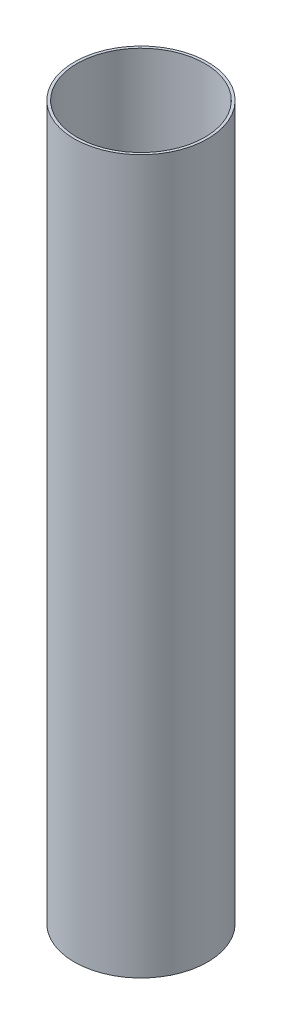
ISO-10303-21;
HEADER;
FILE_DESCRIPTION(('STEP AP214'),'2;1');
FILE_NAME('part.step','',(''),(''),'','','');
FILE_SCHEMA(('AUTOMOTIVE_DESIGN { 1 0 10303 214 1 1 1 1 }'));
ENDSEC;
DATA;
#1=APPLICATION_CONTEXT('core data for automotive mechanical design processes');
#2=APPLICATION_PROTOCOL_DEFINITION('international standard','automotive_design',2000,#1);
#3=PRODUCT_CONTEXT('',#1,'mechanical');
#4=PRODUCT('Part','Part','',(#3));
#5=PRODUCT_RELATED_PRODUCT_CATEGORY('part','',(#4));
#6=PRODUCT_DEFINITION_FORMATION('','',#4);
#7=PRODUCT_DEFINITION_CONTEXT('part definition',#1,'design');
#8=PRODUCT_DEFINITION('design','',#6,#7);
#9=PRODUCT_DEFINITION_SHAPE('','',#8);
#10=(LENGTH_UNIT() NAMED_UNIT(*) SI_UNIT(.MILLI.,.METRE.));
#11=(NAMED_UNIT(*) PLANE_ANGLE_UNIT() SI_UNIT($,.RADIAN.));
#12=(NAMED_UNIT(*) SI_UNIT($,.STERADIAN.) SOLID_ANGLE_UNIT());
#13=UNCERTAINTY_MEASURE_WITH_UNIT(LENGTH_MEASURE(1.E-05),#10,'distance_accuracy_value','');
#14=(GEOMETRIC_REPRESENTATION_CONTEXT(3) GLOBAL_UNCERTAINTY_ASSIGNED_CONTEXT((#13)) GLOBAL_UNIT_ASSIGNED_CONTEXT((#10,
#11,#12)) REPRESENTATION_CONTEXT('',''));
#15=CARTESIAN_POINT('',(0.,0.,0.));
#16=DIRECTION('',(0.,0.,1.));
#17=DIRECTION('',(1.,0.,0.));
#18=AXIS2_PLACEMENT_3D('',#15,#16,#17);
#19=CARTESIAN_POINT('',(0.,304.8,0.));
#20=DIRECTION('',(0.,1.,0.));
#21=DIRECTION('',(0.,0.,1.));
#22=AXIS2_PLACEMENT_3D('',#19,#20,#21);
#23=PLANE('',#22);
#24=CARTESIAN_POINT('',(0.,304.8,0.));
#25=DIRECTION('',(0.,1.,0.));
#26=DIRECTION('',(0.,0.,1.));
#27=AXIS2_PLACEMENT_3D('',#24,#25,#26);
#28=CIRCLE('',#27,28.4734);
#29=CARTESIAN_POINT('',(0.,304.8,28.4734));
#30=VERTEX_POINT('',#29);
#31=EDGE_CURVE('E10',#30,#30,#28,.T.);
#32=ORIENTED_EDGE('',*,*,#31,.T.);
#33=EDGE_LOOP('',(#32));
#34=FACE_BOUND('',#33,.T.);
#35=CARTESIAN_POINT('',(0.,304.8,0.));
#36=DIRECTION('',(0.,1.,0.));
#37=DIRECTION('',(0.,0.,1.));
#38=AXIS2_PLACEMENT_3D('',#35,#36,#37);
#39=CIRCLE('',#38,27.3304);
#40=CARTESIAN_POINT('',(0.,304.8,27.3304));
#41=VERTEX_POINT('',#40);
#42=EDGE_CURVE('E42',#41,#41,#39,.T.);
#43=ORIENTED_EDGE('',*,*,#42,.F.);
#44=EDGE_LOOP('',(#43));
#45=FACE_BOUND('',#44,.T.);
#46=ADVANCED_FACE('F31',(#34,#45),#23,.T.);
#47=CARTESIAN_POINT('',(0.,0.,0.));
#48=DIRECTION('',(0.,1.,0.));
#49=DIRECTION('',(0.,0.,1.));
#50=AXIS2_PLACEMENT_3D('',#47,#48,#49);
#51=PLANE('',#50);
#52=CARTESIAN_POINT('',(0.,0.,0.));
#53=DIRECTION('',(0.,1.,0.));
#54=DIRECTION('',(0.,0.,1.));
#55=AXIS2_PLACEMENT_3D('',#52,#53,#54);
#56=CIRCLE('',#55,28.4734);
#57=CARTESIAN_POINT('',(0.,0.,28.4734));
#58=VERTEX_POINT('',#57);
#59=EDGE_CURVE('E35',#58,#58,#56,.T.);
#60=ORIENTED_EDGE('',*,*,#59,.F.);
#61=EDGE_LOOP('',(#60));
#62=FACE_BOUND('',#61,.T.);
#63=CARTESIAN_POINT('',(0.,0.,0.));
#64=DIRECTION('',(0.,1.,0.));
#65=DIRECTION('',(0.,0.,1.));
#66=AXIS2_PLACEMENT_3D('',#63,#64,#65);
#67=CIRCLE('',#66,27.3304);
#68=CARTESIAN_POINT('',(0.,0.,27.3304));
#69=VERTEX_POINT('',#68);
#70=EDGE_CURVE('E44',#69,#69,#67,.T.);
#71=ORIENTED_EDGE('',*,*,#70,.T.);
#72=EDGE_LOOP('',(#71));
#73=FACE_BOUND('',#72,.T.);
#74=ADVANCED_FACE('F54',(#62,#73),#51,.F.);
#75=CARTESIAN_POINT('',(0.,304.8,0.));
#76=DIRECTION('',(0.,-1.,0.));
#77=DIRECTION('',(0.,0.,-1.));
#78=AXIS2_PLACEMENT_3D('',#75,#76,#77);
#79=CYLINDRICAL_SURFACE('',#78,28.4734);
#80=ORIENTED_EDGE('',*,*,#31,.F.);
#81=EDGE_LOOP('',(#80));
#82=FACE_BOUND('',#81,.T.);
#83=ORIENTED_EDGE('',*,*,#59,.T.);
#84=EDGE_LOOP('',(#83));
#85=FACE_BOUND('',#84,.T.);
#86=ADVANCED_FACE('F33',(#82,#85),#79,.T.);
#87=CARTESIAN_POINT('',(0.,304.8,0.));
#88=DIRECTION('',(0.,-1.,0.));
#89=DIRECTION('',(0.,0.,-1.));
#90=AXIS2_PLACEMENT_3D('',#87,#88,#89);
#91=CYLINDRICAL_SURFACE('',#90,27.3304);
#92=ORIENTED_EDGE('',*,*,#42,.T.);
#93=EDGE_LOOP('',(#92));
#94=FACE_BOUND('',#93,.T.);
#95=ORIENTED_EDGE('',*,*,#70,.F.);
#96=EDGE_LOOP('',(#95));
#97=FACE_BOUND('',#96,.T.);
#98=ADVANCED_FACE('F50',(#94,#97),#91,.F.);
#99=CLOSED_SHELL('',(#46,#74,#86,#98));
#100=MANIFOLD_SOLID_BREP('B2',#99);
#101=ADVANCED_BREP_SHAPE_REPRESENTATION('',(#18,#100),#14);
#102=SHAPE_DEFINITION_REPRESENTATION(#9,#101);
ENDSEC;
END-ISO-10303-21;
